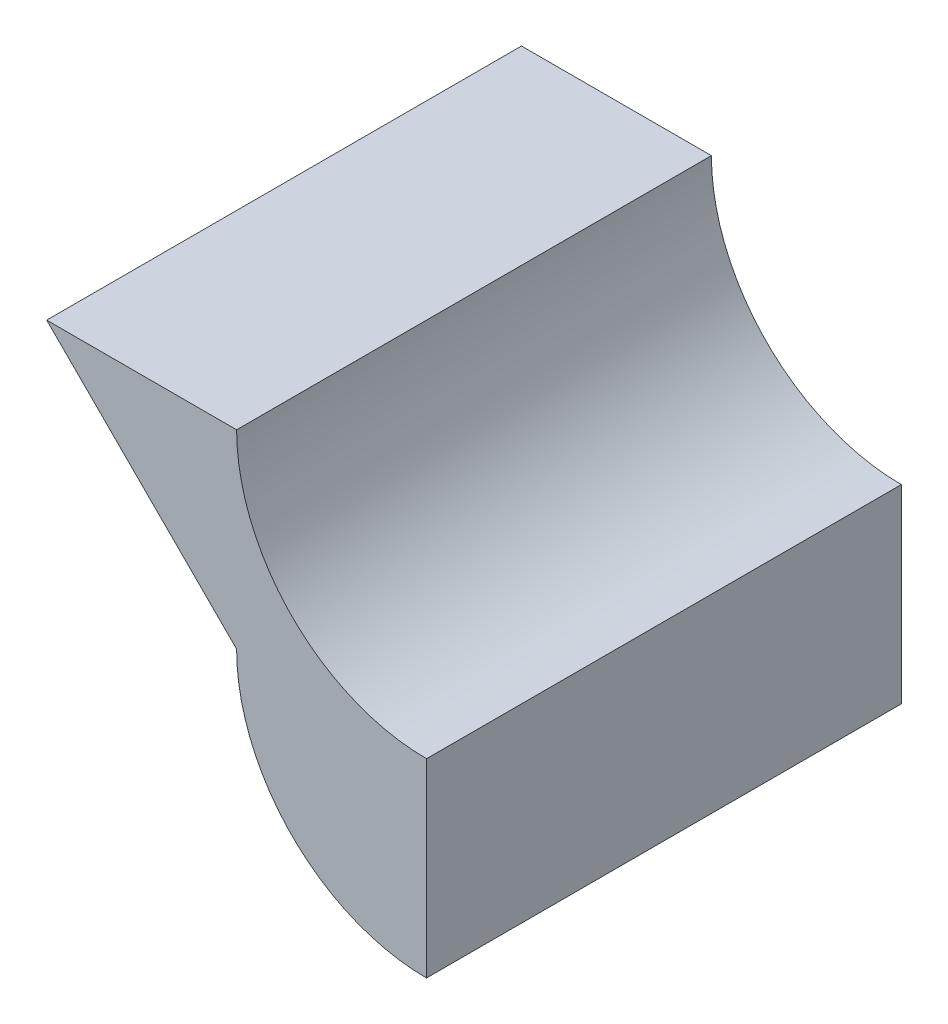
ISO-10303-21;
HEADER;
FILE_DESCRIPTION(('STEP AP214'),'2;1');
FILE_NAME('part.step','',(''),(''),'','','');
FILE_SCHEMA(('AUTOMOTIVE_DESIGN { 1 0 10303 214 1 1 1 1 }'));
ENDSEC;
DATA;
#1=APPLICATION_CONTEXT('core data for automotive mechanical design processes');
#2=APPLICATION_PROTOCOL_DEFINITION('international standard','automotive_design',2000,#1);
#3=PRODUCT_CONTEXT('',#1,'mechanical');
#4=PRODUCT('Part','Part','',(#3));
#5=PRODUCT_RELATED_PRODUCT_CATEGORY('part','',(#4));
#6=PRODUCT_DEFINITION_FORMATION('','',#4);
#7=PRODUCT_DEFINITION_CONTEXT('part definition',#1,'design');
#8=PRODUCT_DEFINITION('design','',#6,#7);
#9=PRODUCT_DEFINITION_SHAPE('','',#8);
#10=(LENGTH_UNIT() NAMED_UNIT(*) SI_UNIT(.MILLI.,.METRE.));
#11=(NAMED_UNIT(*) PLANE_ANGLE_UNIT() SI_UNIT($,.RADIAN.));
#12=(NAMED_UNIT(*) SI_UNIT($,.STERADIAN.) SOLID_ANGLE_UNIT());
#13=UNCERTAINTY_MEASURE_WITH_UNIT(LENGTH_MEASURE(1.E-05),#10,'distance_accuracy_value','');
#14=(GEOMETRIC_REPRESENTATION_CONTEXT(3) GLOBAL_UNCERTAINTY_ASSIGNED_CONTEXT((#13)) GLOBAL_UNIT_ASSIGNED_CONTEXT((#10,
#11,#12)) REPRESENTATION_CONTEXT('',''));
#15=CARTESIAN_POINT('',(0.,0.,0.));
#16=DIRECTION('',(0.,0.,1.));
#17=DIRECTION('',(1.,0.,0.));
#18=AXIS2_PLACEMENT_3D('',#15,#16,#17);
#19=CARTESIAN_POINT('',(-20.,20.,25.));
#20=DIRECTION('',(0.707106781186547,0.707106781186548,0.));
#21=DIRECTION('',(-0.707106781186548,0.707106781186547,0.));
#22=AXIS2_PLACEMENT_3D('',#19,#20,#21);
#23=PLANE('',#22);
#24=DIRECTION('',(0.707106781186548,-0.707106781186547,0.));
#25=VECTOR('',#24,1.);
#26=CARTESIAN_POINT('',(-20.,20.,0.));
#27=LINE('',#26,#25);
#28=CARTESIAN_POINT('',(-20.,20.,0.));
#29=VERTEX_POINT('',#28);
#30=CARTESIAN_POINT('',(-10.,10.,0.));
#31=VERTEX_POINT('',#30);
#32=EDGE_CURVE('E107',#29,#31,#27,.T.);
#33=ORIENTED_EDGE('',*,*,#32,.T.);
#34=DIRECTION('',(0.,0.,-1.));
#35=VECTOR('',#34,1.);
#36=CARTESIAN_POINT('',(-10.,10.,25.));
#37=LINE('',#36,#35);
#38=CARTESIAN_POINT('',(-10.,10.,25.));
#39=VERTEX_POINT('',#38);
#40=EDGE_CURVE('E11',#39,#31,#37,.T.);
#41=ORIENTED_EDGE('',*,*,#40,.F.);
#42=DIRECTION('',(0.707106781186548,-0.707106781186547,0.));
#43=VECTOR('',#42,1.);
#44=CARTESIAN_POINT('',(-20.,20.,25.));
#45=LINE('',#44,#43);
#46=CARTESIAN_POINT('',(-20.,20.,25.));
#47=VERTEX_POINT('',#46);
#48=EDGE_CURVE('E115',#47,#39,#45,.T.);
#49=ORIENTED_EDGE('',*,*,#48,.F.);
#50=DIRECTION('',(0.,0.,-1.));
#51=VECTOR('',#50,1.);
#52=CARTESIAN_POINT('',(-20.,20.,25.));
#53=LINE('',#52,#51);
#54=EDGE_CURVE('E103',#47,#29,#53,.T.);
#55=ORIENTED_EDGE('',*,*,#54,.T.);
#56=EDGE_LOOP('',(#33,#41,#49,#55));
#57=FACE_BOUND('',#56,.T.);
#58=ADVANCED_FACE('F33',(#57),#23,.F.);
#59=CARTESIAN_POINT('',(0.,10.,25.));
#60=DIRECTION('',(0.,0.,-1.));
#61=DIRECTION('',(-1.,0.,0.));
#62=AXIS2_PLACEMENT_3D('',#59,#60,#61);
#63=CYLINDRICAL_SURFACE('',#62,10.);
#64=CARTESIAN_POINT('',(0.,10.,0.));
#65=DIRECTION('',(0.,0.,1.));
#66=DIRECTION('',(1.,0.,0.));
#67=AXIS2_PLACEMENT_3D('',#64,#65,#66);
#68=CIRCLE('',#67,10.);
#69=CARTESIAN_POINT('',(0.,0.,0.));
#70=VERTEX_POINT('',#69);
#71=EDGE_CURVE('E110',#31,#70,#68,.T.);
#72=ORIENTED_EDGE('',*,*,#71,.T.);
#73=DIRECTION('',(0.,0.,-1.));
#74=VECTOR('',#73,1.);
#75=CARTESIAN_POINT('',(0.,0.,25.));
#76=LINE('',#75,#74);
#77=CARTESIAN_POINT('',(0.,0.,25.));
#78=VERTEX_POINT('',#77);
#79=EDGE_CURVE('E41',#78,#70,#76,.T.);
#80=ORIENTED_EDGE('',*,*,#79,.F.);
#81=CARTESIAN_POINT('',(0.,10.,25.));
#82=DIRECTION('',(0.,0.,1.));
#83=DIRECTION('',(1.,0.,0.));
#84=AXIS2_PLACEMENT_3D('',#81,#82,#83);
#85=CIRCLE('',#84,10.);
#86=EDGE_CURVE('E83',#39,#78,#85,.T.);
#87=ORIENTED_EDGE('',*,*,#86,.F.);
#88=ORIENTED_EDGE('',*,*,#40,.T.);
#89=EDGE_LOOP('',(#72,#80,#87,#88));
#90=FACE_BOUND('',#89,.T.);
#91=ADVANCED_FACE('F134',(#90),#63,.T.);
#92=CARTESIAN_POINT('',(0.,10.,25.));
#93=DIRECTION('',(-1.,0.,0.));
#94=DIRECTION('',(0.,0.,1.));
#95=AXIS2_PLACEMENT_3D('',#92,#93,#94);
#96=PLANE('',#95);
#97=DIRECTION('',(0.,1.,0.));
#98=VECTOR('',#97,1.);
#99=CARTESIAN_POINT('',(0.,10.,0.));
#100=LINE('',#99,#98);
#101=CARTESIAN_POINT('',(0.,10.,0.));
#102=VERTEX_POINT('',#101);
#103=EDGE_CURVE('E98',#70,#102,#100,.T.);
#104=ORIENTED_EDGE('',*,*,#103,.T.);
#105=DIRECTION('',(0.,0.,-1.));
#106=VECTOR('',#105,1.);
#107=CARTESIAN_POINT('',(0.,10.,25.));
#108=LINE('',#107,#106);
#109=CARTESIAN_POINT('',(0.,10.,25.));
#110=VERTEX_POINT('',#109);
#111=EDGE_CURVE('E95',#110,#102,#108,.T.);
#112=ORIENTED_EDGE('',*,*,#111,.F.);
#113=DIRECTION('',(0.,1.,0.));
#114=VECTOR('',#113,1.);
#115=CARTESIAN_POINT('',(0.,10.,25.));
#116=LINE('',#115,#114);
#117=EDGE_CURVE('E87',#78,#110,#116,.T.);
#118=ORIENTED_EDGE('',*,*,#117,.F.);
#119=ORIENTED_EDGE('',*,*,#79,.T.);
#120=EDGE_LOOP('',(#104,#112,#118,#119));
#121=FACE_BOUND('',#120,.T.);
#122=ADVANCED_FACE('F96',(#121),#96,.F.);
#123=CARTESIAN_POINT('',(0.,20.,25.));
#124=DIRECTION('',(0.,0.,-1.));
#125=DIRECTION('',(-1.,0.,0.));
#126=AXIS2_PLACEMENT_3D('',#123,#124,#125);
#127=CYLINDRICAL_SURFACE('',#126,10.);
#128=CARTESIAN_POINT('',(0.,20.,0.));
#129=DIRECTION('',(0.,0.,-1.));
#130=DIRECTION('',(1.,0.,0.));
#131=AXIS2_PLACEMENT_3D('',#128,#129,#130);
#132=CIRCLE('',#131,10.);
#133=CARTESIAN_POINT('',(-10.,20.,0.));
#134=VERTEX_POINT('',#133);
#135=EDGE_CURVE('E69',#102,#134,#132,.T.);
#136=ORIENTED_EDGE('',*,*,#135,.T.);
#137=DIRECTION('',(0.,0.,-1.));
#138=VECTOR('',#137,1.);
#139=CARTESIAN_POINT('',(-10.,20.,25.));
#140=LINE('',#139,#138);
#141=CARTESIAN_POINT('',(-10.,20.,25.));
#142=VERTEX_POINT('',#141);
#143=EDGE_CURVE('E99',#142,#134,#140,.T.);
#144=ORIENTED_EDGE('',*,*,#143,.F.);
#145=CARTESIAN_POINT('',(0.,20.,25.));
#146=DIRECTION('',(0.,0.,-1.));
#147=DIRECTION('',(1.,0.,0.));
#148=AXIS2_PLACEMENT_3D('',#145,#146,#147);
#149=CIRCLE('',#148,10.);
#150=EDGE_CURVE('E91',#110,#142,#149,.T.);
#151=ORIENTED_EDGE('',*,*,#150,.F.);
#152=ORIENTED_EDGE('',*,*,#111,.T.);
#153=EDGE_LOOP('',(#136,#144,#151,#152));
#154=FACE_BOUND('',#153,.T.);
#155=ADVANCED_FACE('F101',(#154),#127,.F.);
#156=CARTESIAN_POINT('',(-20.,20.,25.));
#157=DIRECTION('',(0.,-1.,0.));
#158=DIRECTION('',(0.,0.,-1.));
#159=AXIS2_PLACEMENT_3D('',#156,#157,#158);
#160=PLANE('',#159);
#161=DIRECTION('',(-1.,0.,0.));
#162=VECTOR('',#161,1.);
#163=CARTESIAN_POINT('',(-20.,20.,0.));
#164=LINE('',#163,#162);
#165=EDGE_CURVE('E75',#134,#29,#164,.T.);
#166=ORIENTED_EDGE('',*,*,#165,.T.);
#167=ORIENTED_EDGE('',*,*,#54,.F.);
#168=DIRECTION('',(-1.,0.,0.));
#169=VECTOR('',#168,1.);
#170=CARTESIAN_POINT('',(-20.,20.,25.));
#171=LINE('',#170,#169);
#172=EDGE_CURVE('E49',#142,#47,#171,.T.);
#173=ORIENTED_EDGE('',*,*,#172,.F.);
#174=ORIENTED_EDGE('',*,*,#143,.T.);
#175=EDGE_LOOP('',(#166,#167,#173,#174));
#176=FACE_BOUND('',#175,.T.);
#177=ADVANCED_FACE('F123',(#176),#160,.F.);
#178=CARTESIAN_POINT('',(0.,10.,25.));
#179=DIRECTION('',(0.,0.,1.));
#180=DIRECTION('',(1.,0.,0.));
#181=AXIS2_PLACEMENT_3D('',#178,#179,#180);
#182=PLANE('',#181);
#183=ORIENTED_EDGE('',*,*,#48,.T.);
#184=ORIENTED_EDGE('',*,*,#86,.T.);
#185=ORIENTED_EDGE('',*,*,#117,.T.);
#186=ORIENTED_EDGE('',*,*,#150,.T.);
#187=ORIENTED_EDGE('',*,*,#172,.T.);
#188=EDGE_LOOP('',(#183,#184,#185,#186,#187));
#189=FACE_BOUND('',#188,.T.);
#190=ADVANCED_FACE('F89',(#189),#182,.T.);
#191=CARTESIAN_POINT('',(0.,10.,0.));
#192=DIRECTION('',(0.,0.,1.));
#193=DIRECTION('',(1.,0.,0.));
#194=AXIS2_PLACEMENT_3D('',#191,#192,#193);
#195=PLANE('',#194);
#196=ORIENTED_EDGE('',*,*,#32,.F.);
#197=ORIENTED_EDGE('',*,*,#165,.F.);
#198=ORIENTED_EDGE('',*,*,#135,.F.);
#199=ORIENTED_EDGE('',*,*,#103,.F.);
#200=ORIENTED_EDGE('',*,*,#71,.F.);
#201=EDGE_LOOP('',(#196,#197,#198,#199,#200));
#202=FACE_BOUND('',#201,.T.);
#203=ADVANCED_FACE('F119',(#202),#195,.F.);
#204=CLOSED_SHELL('',(#58,#91,#122,#155,#177,#190,#203));
#205=MANIFOLD_SOLID_BREP('B2',#204);
#206=ADVANCED_BREP_SHAPE_REPRESENTATION('',(#18,#205),#14);
#207=SHAPE_DEFINITION_REPRESENTATION(#9,#206);
ENDSEC;
END-ISO-10303-21;
